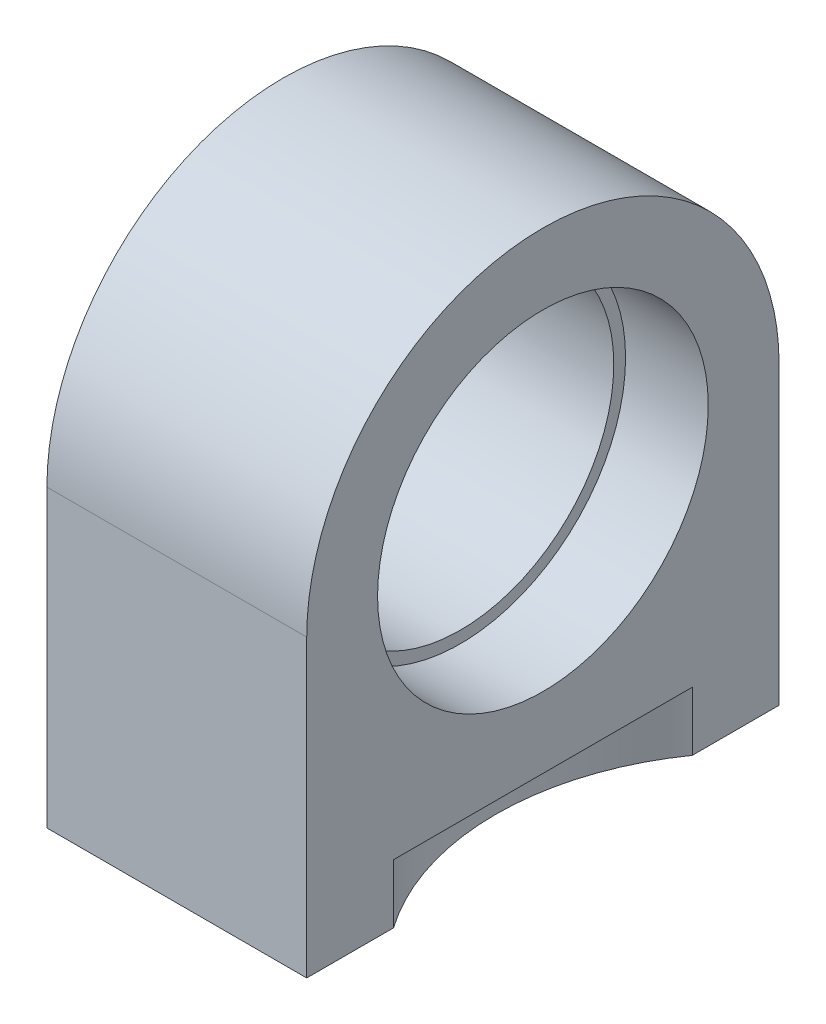
ISO-10303-21;
HEADER;
FILE_DESCRIPTION(('STEP AP214'),'2;1');
FILE_NAME('part.step','',(''),(''),'','','');
FILE_SCHEMA(('AUTOMOTIVE_DESIGN { 1 0 10303 214 1 1 1 1 }'));
ENDSEC;
DATA;
#1=APPLICATION_CONTEXT('core data for automotive mechanical design processes');
#2=APPLICATION_PROTOCOL_DEFINITION('international standard','automotive_design',2000,#1);
#3=PRODUCT_CONTEXT('',#1,'mechanical');
#4=PRODUCT('Part','Part','',(#3));
#5=PRODUCT_RELATED_PRODUCT_CATEGORY('part','',(#4));
#6=PRODUCT_DEFINITION_FORMATION('','',#4);
#7=PRODUCT_DEFINITION_CONTEXT('part definition',#1,'design');
#8=PRODUCT_DEFINITION('design','',#6,#7);
#9=PRODUCT_DEFINITION_SHAPE('','',#8);
#10=(LENGTH_UNIT() NAMED_UNIT(*) SI_UNIT(.MILLI.,.METRE.));
#11=(NAMED_UNIT(*) PLANE_ANGLE_UNIT() SI_UNIT($,.RADIAN.));
#12=(NAMED_UNIT(*) SI_UNIT($,.STERADIAN.) SOLID_ANGLE_UNIT());
#13=UNCERTAINTY_MEASURE_WITH_UNIT(LENGTH_MEASURE(1.E-05),#10,'distance_accuracy_value','');
#14=(GEOMETRIC_REPRESENTATION_CONTEXT(3) GLOBAL_UNCERTAINTY_ASSIGNED_CONTEXT((#13)) GLOBAL_UNIT_ASSIGNED_CONTEXT((#10,
#11,#12)) REPRESENTATION_CONTEXT('',''));
#15=CARTESIAN_POINT('',(0.,0.,0.));
#16=DIRECTION('',(0.,0.,1.));
#17=DIRECTION('',(1.,0.,0.));
#18=AXIS2_PLACEMENT_3D('',#15,#16,#17);
#19=CARTESIAN_POINT('',(11.,0.,0.));
#20=DIRECTION('',(-1.,0.,0.));
#21=DIRECTION('',(0.,0.,1.));
#22=AXIS2_PLACEMENT_3D('',#19,#20,#21);
#23=CYLINDRICAL_SURFACE('',#22,6.5);
#24=CARTESIAN_POINT('',(0.,0.,0.));
#25=DIRECTION('',(1.,0.,0.));
#26=DIRECTION('',(0.,0.,-1.));
#27=AXIS2_PLACEMENT_3D('',#24,#25,#26);
#28=CIRCLE('',#27,6.5);
#29=CARTESIAN_POINT('',(0.,0.,-6.5));
#30=VERTEX_POINT('',#29);
#31=EDGE_CURVE('E131',#30,#30,#28,.T.);
#32=ORIENTED_EDGE('',*,*,#31,.F.);
#33=EDGE_LOOP('',(#32));
#34=FACE_BOUND('',#33,.T.);
#35=CARTESIAN_POINT('',(7.5,0.,0.));
#36=DIRECTION('',(1.,0.,0.));
#37=DIRECTION('',(0.,0.,-1.));
#38=AXIS2_PLACEMENT_3D('',#35,#36,#37);
#39=CIRCLE('',#38,6.5);
#40=CARTESIAN_POINT('',(7.5,0.,-6.5));
#41=VERTEX_POINT('',#40);
#42=EDGE_CURVE('E128',#41,#41,#39,.T.);
#43=ORIENTED_EDGE('',*,*,#42,.T.);
#44=EDGE_LOOP('',(#43));
#45=FACE_BOUND('',#44,.T.);
#46=ADVANCED_FACE('F34',(#34,#45),#23,.F.);
#47=CARTESIAN_POINT('',(11.,0.,0.));
#48=DIRECTION('',(-1.,0.,0.));
#49=DIRECTION('',(0.,0.,1.));
#50=AXIS2_PLACEMENT_3D('',#47,#48,#49);
#51=PLANE('',#50);
#52=CARTESIAN_POINT('',(11.,0.,0.));
#53=DIRECTION('',(1.,0.,0.));
#54=DIRECTION('',(0.,0.,-1.));
#55=AXIS2_PLACEMENT_3D('',#52,#53,#54);
#56=CIRCLE('',#55,7.);
#57=CARTESIAN_POINT('',(11.,0.,-7.));
#58=VERTEX_POINT('',#57);
#59=EDGE_CURVE('E116',#58,#58,#56,.T.);
#60=ORIENTED_EDGE('',*,*,#59,.F.);
#61=EDGE_LOOP('',(#60));
#62=FACE_BOUND('',#61,.T.);
#63=DIRECTION('',(0.,0.,1.));
#64=VECTOR('',#63,1.);
#65=CARTESIAN_POINT('',(11.,-10.,0.));
#66=LINE('',#65,#64);
#67=CARTESIAN_POINT('',(11.,-10.,-6.32455532033676));
#68=VERTEX_POINT('',#67);
#69=CARTESIAN_POINT('',(11.,-10.,6.32455532033676));
#70=VERTEX_POINT('',#69);
#71=EDGE_CURVE('E11',#68,#70,#66,.T.);
#72=ORIENTED_EDGE('',*,*,#71,.F.);
#73=DIRECTION('',(0.,-1.,0.));
#74=VECTOR('',#73,1.);
#75=CARTESIAN_POINT('',(11.,-10.,-6.32455532033676));
#76=LINE('',#75,#74);
#77=CARTESIAN_POINT('',(11.,-12.5,-6.32455532033676));
#78=VERTEX_POINT('',#77);
#79=EDGE_CURVE('E101',#68,#78,#76,.T.);
#80=ORIENTED_EDGE('',*,*,#79,.T.);
#81=DIRECTION('',(0.,0.,-1.));
#82=VECTOR('',#81,1.);
#83=CARTESIAN_POINT('',(11.,-12.5,10.));
#84=LINE('',#83,#82);
#85=CARTESIAN_POINT('',(11.,-12.5,-10.));
#86=VERTEX_POINT('',#85);
#87=EDGE_CURVE('E138',#78,#86,#84,.T.);
#88=ORIENTED_EDGE('',*,*,#87,.T.);
#89=DIRECTION('',(0.,1.,0.));
#90=VECTOR('',#89,1.);
#91=CARTESIAN_POINT('',(11.,-12.5,-10.));
#92=LINE('',#91,#90);
#93=CARTESIAN_POINT('',(11.,0.,-10.));
#94=VERTEX_POINT('',#93);
#95=EDGE_CURVE('E58',#86,#94,#92,.T.);
#96=ORIENTED_EDGE('',*,*,#95,.T.);
#97=CARTESIAN_POINT('',(11.,0.,0.));
#98=DIRECTION('',(1.,0.,0.));
#99=DIRECTION('',(0.,0.,1.));
#100=AXIS2_PLACEMENT_3D('',#97,#98,#99);
#101=CIRCLE('',#100,10.);
#102=CARTESIAN_POINT('',(11.,0.,10.));
#103=VERTEX_POINT('',#102);
#104=EDGE_CURVE('E135',#94,#103,#101,.T.);
#105=ORIENTED_EDGE('',*,*,#104,.T.);
#106=DIRECTION('',(0.,-1.,0.));
#107=VECTOR('',#106,1.);
#108=CARTESIAN_POINT('',(11.,0.,10.));
#109=LINE('',#108,#107);
#110=CARTESIAN_POINT('',(11.,-12.5,10.));
#111=VERTEX_POINT('',#110);
#112=EDGE_CURVE('E87',#103,#111,#109,.T.);
#113=ORIENTED_EDGE('',*,*,#112,.T.);
#114=CARTESIAN_POINT('',(11.,-12.5,6.32455532033676));
#115=VERTEX_POINT('',#114);
#116=EDGE_CURVE('E107',#111,#115,#84,.T.);
#117=ORIENTED_EDGE('',*,*,#116,.T.);
#118=DIRECTION('',(0.,-1.,0.));
#119=VECTOR('',#118,1.);
#120=CARTESIAN_POINT('',(11.,-10.,6.32455532033676));
#121=LINE('',#120,#119);
#122=EDGE_CURVE('E49',#115,#70,#121,.F.);
#123=ORIENTED_EDGE('',*,*,#122,.T.);
#124=EDGE_LOOP('',(#72,#80,#88,#96,#105,#113,#117,#123));
#125=FACE_BOUND('',#124,.T.);
#126=ADVANCED_FACE('F105',(#62,#125),#51,.F.);
#127=CARTESIAN_POINT('',(0.,0.,0.));
#128=DIRECTION('',(-1.,0.,0.));
#129=DIRECTION('',(0.,0.,1.));
#130=AXIS2_PLACEMENT_3D('',#127,#128,#129);
#131=PLANE('',#130);
#132=CARTESIAN_POINT('',(0.,0.,0.));
#133=DIRECTION('',(1.,0.,0.));
#134=DIRECTION('',(0.,0.,1.));
#135=AXIS2_PLACEMENT_3D('',#132,#133,#134);
#136=CIRCLE('',#135,10.);
#137=CARTESIAN_POINT('',(0.,0.,-10.));
#138=VERTEX_POINT('',#137);
#139=CARTESIAN_POINT('',(0.,0.,10.));
#140=VERTEX_POINT('',#139);
#141=EDGE_CURVE('E134',#138,#140,#136,.T.);
#142=ORIENTED_EDGE('',*,*,#141,.F.);
#143=DIRECTION('',(0.,1.,0.));
#144=VECTOR('',#143,1.);
#145=CARTESIAN_POINT('',(0.,-12.5,-10.));
#146=LINE('',#145,#144);
#147=CARTESIAN_POINT('',(0.,-12.5,-10.));
#148=VERTEX_POINT('',#147);
#149=EDGE_CURVE('E79',#148,#138,#146,.T.);
#150=ORIENTED_EDGE('',*,*,#149,.F.);
#151=DIRECTION('',(0.,0.,-1.));
#152=VECTOR('',#151,1.);
#153=CARTESIAN_POINT('',(0.,-12.5,10.));
#154=LINE('',#153,#152);
#155=CARTESIAN_POINT('',(0.,-12.5,10.));
#156=VERTEX_POINT('',#155);
#157=EDGE_CURVE('E146',#156,#148,#154,.T.);
#158=ORIENTED_EDGE('',*,*,#157,.F.);
#159=DIRECTION('',(0.,-1.,0.));
#160=VECTOR('',#159,1.);
#161=CARTESIAN_POINT('',(0.,0.,10.));
#162=LINE('',#161,#160);
#163=EDGE_CURVE('E144',#140,#156,#162,.T.);
#164=ORIENTED_EDGE('',*,*,#163,.F.);
#165=EDGE_LOOP('',(#142,#150,#158,#164));
#166=FACE_BOUND('',#165,.T.);
#167=ORIENTED_EDGE('',*,*,#31,.T.);
#168=EDGE_LOOP('',(#167));
#169=FACE_BOUND('',#168,.T.);
#170=ADVANCED_FACE('F174',(#166,#169),#131,.T.);
#171=CARTESIAN_POINT('',(11.,0.,0.));
#172=DIRECTION('',(-1.,0.,0.));
#173=DIRECTION('',(0.,0.,1.));
#174=AXIS2_PLACEMENT_3D('',#171,#172,#173);
#175=CYLINDRICAL_SURFACE('',#174,10.);
#176=ORIENTED_EDGE('',*,*,#141,.T.);
#177=DIRECTION('',(-1.,0.,0.));
#178=VECTOR('',#177,1.);
#179=CARTESIAN_POINT('',(11.,0.,10.));
#180=LINE('',#179,#178);
#181=EDGE_CURVE('E42',#103,#140,#180,.T.);
#182=ORIENTED_EDGE('',*,*,#181,.F.);
#183=ORIENTED_EDGE('',*,*,#104,.F.);
#184=DIRECTION('',(-1.,0.,0.));
#185=VECTOR('',#184,1.);
#186=CARTESIAN_POINT('',(11.,0.,-10.));
#187=LINE('',#186,#185);
#188=EDGE_CURVE('E141',#94,#138,#187,.T.);
#189=ORIENTED_EDGE('',*,*,#188,.T.);
#190=EDGE_LOOP('',(#176,#182,#183,#189));
#191=FACE_BOUND('',#190,.T.);
#192=ADVANCED_FACE('F36',(#191),#175,.T.);
#193=CARTESIAN_POINT('',(11.,0.,10.));
#194=DIRECTION('',(0.,0.,-1.));
#195=DIRECTION('',(0.,1.,0.));
#196=AXIS2_PLACEMENT_3D('',#193,#194,#195);
#197=PLANE('',#196);
#198=ORIENTED_EDGE('',*,*,#163,.T.);
#199=DIRECTION('',(-1.,0.,0.));
#200=VECTOR('',#199,1.);
#201=CARTESIAN_POINT('',(11.,-12.5,10.));
#202=LINE('',#201,#200);
#203=EDGE_CURVE('E152',#111,#156,#202,.T.);
#204=ORIENTED_EDGE('',*,*,#203,.F.);
#205=ORIENTED_EDGE('',*,*,#112,.F.);
#206=ORIENTED_EDGE('',*,*,#181,.T.);
#207=EDGE_LOOP('',(#198,#204,#205,#206));
#208=FACE_BOUND('',#207,.T.);
#209=ADVANCED_FACE('F189',(#208),#197,.F.);
#210=CARTESIAN_POINT('',(11.,-12.5,10.));
#211=DIRECTION('',(0.,1.,0.));
#212=DIRECTION('',(0.,0.,1.));
#213=AXIS2_PLACEMENT_3D('',#210,#211,#212);
#214=PLANE('',#213);
#215=CARTESIAN_POINT('',(6.,-12.5,5.));
#216=DIRECTION('',(0.,-1.,0.));
#217=DIRECTION('',(0.,0.,-1.));
#218=AXIS2_PLACEMENT_3D('',#215,#216,#217);
#219=CIRCLE('',#218,2.75);
#220=CARTESIAN_POINT('',(6.,-12.5,2.25));
#221=VERTEX_POINT('',#220);
#222=EDGE_CURVE('E117',#221,#221,#219,.T.);
#223=ORIENTED_EDGE('',*,*,#222,.F.);
#224=EDGE_LOOP('',(#223));
#225=FACE_BOUND('',#224,.T.);
#226=CARTESIAN_POINT('',(6.,-12.5,-5.));
#227=DIRECTION('',(0.,-1.,0.));
#228=DIRECTION('',(0.,0.,-1.));
#229=AXIS2_PLACEMENT_3D('',#226,#227,#228);
#230=CIRCLE('',#229,2.75);
#231=CARTESIAN_POINT('',(6.,-12.5,-7.75));
#232=VERTEX_POINT('',#231);
#233=EDGE_CURVE('E109',#232,#232,#230,.T.);
#234=ORIENTED_EDGE('',*,*,#233,.F.);
#235=EDGE_LOOP('',(#234));
#236=FACE_BOUND('',#235,.T.);
#237=ORIENTED_EDGE('',*,*,#87,.F.);
#238=CARTESIAN_POINT('',(20.,-12.5,0.));
#239=DIRECTION('',(0.,-1.,0.));
#240=DIRECTION('',(0.,0.,-1.));
#241=AXIS2_PLACEMENT_3D('',#238,#239,#240);
#242=CIRCLE('',#241,11.);
#243=EDGE_CURVE('E102',#115,#78,#242,.T.);
#244=ORIENTED_EDGE('',*,*,#243,.F.);
#245=ORIENTED_EDGE('',*,*,#116,.F.);
#246=ORIENTED_EDGE('',*,*,#203,.T.);
#247=ORIENTED_EDGE('',*,*,#157,.T.);
#248=DIRECTION('',(-1.,0.,0.));
#249=VECTOR('',#248,1.);
#250=CARTESIAN_POINT('',(11.,-12.5,-10.));
#251=LINE('',#250,#249);
#252=EDGE_CURVE('E150',#86,#148,#251,.T.);
#253=ORIENTED_EDGE('',*,*,#252,.F.);
#254=EDGE_LOOP('',(#237,#244,#245,#246,#247,#253));
#255=FACE_BOUND('',#254,.T.);
#256=ADVANCED_FACE('F187',(#225,#236,#255),#214,.F.);
#257=CARTESIAN_POINT('',(11.,-12.5,-10.));
#258=DIRECTION('',(0.,0.,1.));
#259=DIRECTION('',(1.,0.,0.));
#260=AXIS2_PLACEMENT_3D('',#257,#258,#259);
#261=PLANE('',#260);
#262=ORIENTED_EDGE('',*,*,#149,.T.);
#263=ORIENTED_EDGE('',*,*,#188,.F.);
#264=ORIENTED_EDGE('',*,*,#95,.F.);
#265=ORIENTED_EDGE('',*,*,#252,.T.);
#266=EDGE_LOOP('',(#262,#263,#264,#265));
#267=FACE_BOUND('',#266,.T.);
#268=ADVANCED_FACE('F169',(#267),#261,.F.);
#269=CARTESIAN_POINT('',(7.5,0.,0.));
#270=DIRECTION('',(1.,0.,0.));
#271=DIRECTION('',(0.,0.,-1.));
#272=AXIS2_PLACEMENT_3D('',#269,#270,#271);
#273=CYLINDRICAL_SURFACE('',#272,7.);
#274=CARTESIAN_POINT('',(7.5,0.,0.));
#275=DIRECTION('',(1.,0.,0.));
#276=DIRECTION('',(0.,0.,-1.));
#277=AXIS2_PLACEMENT_3D('',#274,#275,#276);
#278=CIRCLE('',#277,7.);
#279=CARTESIAN_POINT('',(7.5,0.,-7.));
#280=VERTEX_POINT('',#279);
#281=EDGE_CURVE('E125',#280,#280,#278,.T.);
#282=ORIENTED_EDGE('',*,*,#281,.F.);
#283=EDGE_LOOP('',(#282));
#284=FACE_BOUND('',#283,.T.);
#285=ORIENTED_EDGE('',*,*,#59,.T.);
#286=EDGE_LOOP('',(#285));
#287=FACE_BOUND('',#286,.T.);
#288=ADVANCED_FACE('F163',(#284,#287),#273,.F.);
#289=CARTESIAN_POINT('',(7.5,0.,0.));
#290=DIRECTION('',(1.,0.,0.));
#291=DIRECTION('',(0.,0.,-1.));
#292=AXIS2_PLACEMENT_3D('',#289,#290,#291);
#293=PLANE('',#292);
#294=ORIENTED_EDGE('',*,*,#42,.F.);
#295=EDGE_LOOP('',(#294));
#296=FACE_BOUND('',#295,.T.);
#297=ORIENTED_EDGE('',*,*,#281,.T.);
#298=EDGE_LOOP('',(#297));
#299=FACE_BOUND('',#298,.T.);
#300=ADVANCED_FACE('F159',(#296,#299),#293,.T.);
#301=CARTESIAN_POINT('',(6.,-6.5,-5.));
#302=DIRECTION('',(0.,-1.,0.));
#303=DIRECTION('',(0.,0.,-1.));
#304=AXIS2_PLACEMENT_3D('',#301,#302,#303);
#305=CYLINDRICAL_SURFACE('',#304,2.75);
#306=CARTESIAN_POINT('',(6.,-6.5,-5.));
#307=DIRECTION('',(0.,-1.,0.));
#308=DIRECTION('',(0.,0.,-1.));
#309=AXIS2_PLACEMENT_3D('',#306,#307,#308);
#310=CIRCLE('',#309,2.75);
#311=CARTESIAN_POINT('',(6.,-6.5,-7.75));
#312=VERTEX_POINT('',#311);
#313=EDGE_CURVE('E120',#312,#312,#310,.T.);
#314=ORIENTED_EDGE('',*,*,#313,.F.);
#315=EDGE_LOOP('',(#314));
#316=FACE_BOUND('',#315,.T.);
#317=ORIENTED_EDGE('',*,*,#233,.T.);
#318=EDGE_LOOP('',(#317));
#319=FACE_BOUND('',#318,.T.);
#320=ADVANCED_FACE('F162',(#316,#319),#305,.F.);
#321=CARTESIAN_POINT('',(6.,-6.5,-5.));
#322=DIRECTION('',(0.,-1.,0.));
#323=DIRECTION('',(0.,0.,-1.));
#324=AXIS2_PLACEMENT_3D('',#321,#322,#323);
#325=PLANE('',#324);
#326=ORIENTED_EDGE('',*,*,#313,.T.);
#327=EDGE_LOOP('',(#326));
#328=FACE_BOUND('',#327,.T.);
#329=ADVANCED_FACE('F256',(#328),#325,.T.);
#330=CARTESIAN_POINT('',(6.,-6.5,5.));
#331=DIRECTION('',(0.,-1.,0.));
#332=DIRECTION('',(0.,0.,-1.));
#333=AXIS2_PLACEMENT_3D('',#330,#331,#332);
#334=CYLINDRICAL_SURFACE('',#333,2.75);
#335=CARTESIAN_POINT('',(6.,-6.5,5.));
#336=DIRECTION('',(0.,-1.,0.));
#337=DIRECTION('',(0.,0.,-1.));
#338=AXIS2_PLACEMENT_3D('',#335,#336,#337);
#339=CIRCLE('',#338,2.75);
#340=CARTESIAN_POINT('',(6.,-6.5,2.25));
#341=VERTEX_POINT('',#340);
#342=EDGE_CURVE('E113',#341,#341,#339,.T.);
#343=ORIENTED_EDGE('',*,*,#342,.F.);
#344=EDGE_LOOP('',(#343));
#345=FACE_BOUND('',#344,.T.);
#346=ORIENTED_EDGE('',*,*,#222,.T.);
#347=EDGE_LOOP('',(#346));
#348=FACE_BOUND('',#347,.T.);
#349=ADVANCED_FACE('F265',(#345,#348),#334,.F.);
#350=CARTESIAN_POINT('',(6.,-6.5,5.));
#351=DIRECTION('',(0.,-1.,0.));
#352=DIRECTION('',(0.,0.,-1.));
#353=AXIS2_PLACEMENT_3D('',#350,#351,#352);
#354=PLANE('',#353);
#355=ORIENTED_EDGE('',*,*,#342,.T.);
#356=EDGE_LOOP('',(#355));
#357=FACE_BOUND('',#356,.T.);
#358=ADVANCED_FACE('F274',(#357),#354,.T.);
#359=CARTESIAN_POINT('',(20.,-10.,0.));
#360=DIRECTION('',(0.,-1.,0.));
#361=DIRECTION('',(0.,0.,-1.));
#362=AXIS2_PLACEMENT_3D('',#359,#360,#361);
#363=PLANE('',#362);
#364=ORIENTED_EDGE('',*,*,#71,.T.);
#365=CARTESIAN_POINT('',(20.,-10.,0.));
#366=DIRECTION('',(0.,-1.,0.));
#367=DIRECTION('',(0.,0.,-1.));
#368=AXIS2_PLACEMENT_3D('',#365,#366,#367);
#369=CIRCLE('',#368,11.);
#370=EDGE_CURVE('E98',#70,#68,#369,.T.);
#371=ORIENTED_EDGE('',*,*,#370,.T.);
#372=EDGE_LOOP('',(#364,#371));
#373=FACE_BOUND('',#372,.T.);
#374=ADVANCED_FACE('F97',(#373),#363,.T.);
#375=CARTESIAN_POINT('',(20.,-10.,0.));
#376=DIRECTION('',(0.,-1.,0.));
#377=DIRECTION('',(0.,0.,-1.));
#378=AXIS2_PLACEMENT_3D('',#375,#376,#377);
#379=CYLINDRICAL_SURFACE('',#378,11.);
#380=ORIENTED_EDGE('',*,*,#370,.F.);
#381=ORIENTED_EDGE('',*,*,#122,.F.);
#382=ORIENTED_EDGE('',*,*,#243,.T.);
#383=ORIENTED_EDGE('',*,*,#79,.F.);
#384=EDGE_LOOP('',(#380,#381,#382,#383));
#385=FACE_BOUND('',#384,.T.);
#386=ADVANCED_FACE('F100',(#385),#379,.F.);
#387=CLOSED_SHELL('',(#46,#126,#170,#192,#209,#256,#268,#288,#300,#320,#329,#349,#358,#374,#386));
#388=MANIFOLD_SOLID_BREP('B2',#387);
#389=ADVANCED_BREP_SHAPE_REPRESENTATION('',(#18,#388),#14);
#390=SHAPE_DEFINITION_REPRESENTATION(#9,#389);
ENDSEC;
END-ISO-10303-21;
